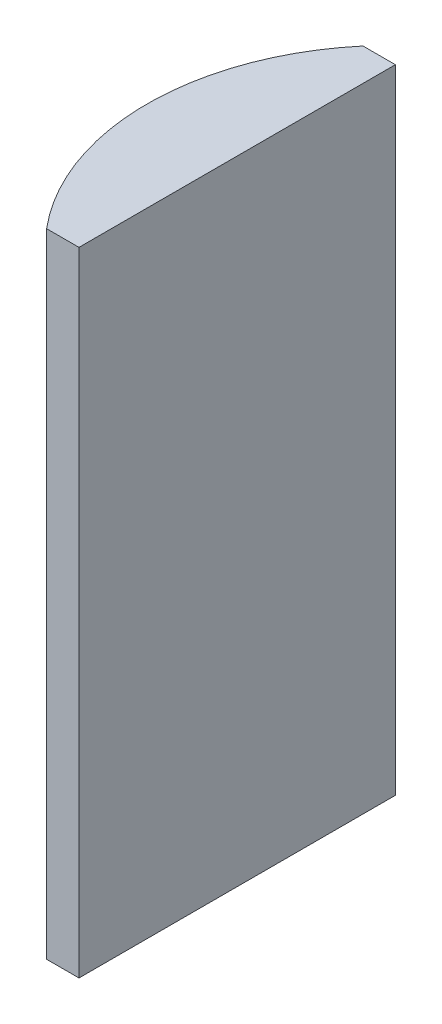
ISO-10303-21;
HEADER;
FILE_DESCRIPTION(('STEP AP214'),'2;1');
FILE_NAME('part.step','',(''),(''),'','','');
FILE_SCHEMA(('AUTOMOTIVE_DESIGN { 1 0 10303 214 1 1 1 1 }'));
ENDSEC;
DATA;
#1=APPLICATION_CONTEXT('core data for automotive mechanical design processes');
#2=APPLICATION_PROTOCOL_DEFINITION('international standard','automotive_design',2000,#1);
#3=PRODUCT_CONTEXT('',#1,'mechanical');
#4=PRODUCT('Part','Part','',(#3));
#5=PRODUCT_RELATED_PRODUCT_CATEGORY('part','',(#4));
#6=PRODUCT_DEFINITION_FORMATION('','',#4);
#7=PRODUCT_DEFINITION_CONTEXT('part definition',#1,'design');
#8=PRODUCT_DEFINITION('design','',#6,#7);
#9=PRODUCT_DEFINITION_SHAPE('','',#8);
#10=(LENGTH_UNIT() NAMED_UNIT(*) SI_UNIT(.MILLI.,.METRE.));
#11=(NAMED_UNIT(*) PLANE_ANGLE_UNIT() SI_UNIT($,.RADIAN.));
#12=(NAMED_UNIT(*) SI_UNIT($,.STERADIAN.) SOLID_ANGLE_UNIT());
#13=UNCERTAINTY_MEASURE_WITH_UNIT(LENGTH_MEASURE(1.E-05),#10,'distance_accuracy_value','');
#14=(GEOMETRIC_REPRESENTATION_CONTEXT(3) GLOBAL_UNCERTAINTY_ASSIGNED_CONTEXT((#13)) GLOBAL_UNIT_ASSIGNED_CONTEXT((#10,
#11,#12)) REPRESENTATION_CONTEXT('',''));
#15=CARTESIAN_POINT('',(0.,0.,0.));
#16=DIRECTION('',(0.,0.,1.));
#17=DIRECTION('',(1.,0.,0.));
#18=AXIS2_PLACEMENT_3D('',#15,#16,#17);
#19=CARTESIAN_POINT('',(4.35520433485127,40.,0.));
#20=DIRECTION('',(0.,-1.,0.));
#21=DIRECTION('',(0.,0.,-1.));
#22=AXIS2_PLACEMENT_3D('',#19,#20,#21);
#23=CYLINDRICAL_SURFACE('',#22,15.51);
#24=CARTESIAN_POINT('',(4.35520433485127,0.,0.));
#25=DIRECTION('',(0.,1.,0.));
#26=DIRECTION('',(0.,0.,1.));
#27=AXIS2_PLACEMENT_3D('',#24,#25,#26);
#28=CIRCLE('',#27,15.51);
#29=CARTESIAN_POINT('',(-7.50060015071613,0.,-10.));
#30=VERTEX_POINT('',#29);
#31=CARTESIAN_POINT('',(-7.50060015071613,0.,10.));
#32=VERTEX_POINT('',#31);
#33=EDGE_CURVE('E100',#30,#32,#28,.T.);
#34=ORIENTED_EDGE('',*,*,#33,.T.);
#35=DIRECTION('',(0.,-1.,0.));
#36=VECTOR('',#35,1.);
#37=CARTESIAN_POINT('',(-7.50060015071613,40.,10.));
#38=LINE('',#37,#36);
#39=CARTESIAN_POINT('',(-7.50060015071613,40.,10.));
#40=VERTEX_POINT('',#39);
#41=EDGE_CURVE('E11',#40,#32,#38,.T.);
#42=ORIENTED_EDGE('',*,*,#41,.F.);
#43=CARTESIAN_POINT('',(4.35520433485127,40.,0.));
#44=DIRECTION('',(0.,1.,0.));
#45=DIRECTION('',(0.,0.,1.));
#46=AXIS2_PLACEMENT_3D('',#43,#44,#45);
#47=CIRCLE('',#46,15.51);
#48=CARTESIAN_POINT('',(-7.50060015071613,40.,-10.));
#49=VERTEX_POINT('',#48);
#50=EDGE_CURVE('E88',#49,#40,#47,.T.);
#51=ORIENTED_EDGE('',*,*,#50,.F.);
#52=DIRECTION('',(0.,-1.,0.));
#53=VECTOR('',#52,1.);
#54=CARTESIAN_POINT('',(-7.50060015071613,40.,-10.));
#55=LINE('',#54,#53);
#56=EDGE_CURVE('E96',#49,#30,#55,.T.);
#57=ORIENTED_EDGE('',*,*,#56,.T.);
#58=EDGE_LOOP('',(#34,#42,#51,#57));
#59=FACE_BOUND('',#58,.T.);
#60=ADVANCED_FACE('F37',(#59),#23,.T.);
#61=CARTESIAN_POINT('',(-7.50060015071613,40.,10.));
#62=DIRECTION('',(0.,0.,-1.));
#63=DIRECTION('',(-1.,0.,0.));
#64=AXIS2_PLACEMENT_3D('',#61,#62,#63);
#65=PLANE('',#64);
#66=DIRECTION('',(1.,0.,0.));
#67=VECTOR('',#66,1.);
#68=CARTESIAN_POINT('',(-7.50060015071613,0.,10.));
#69=LINE('',#68,#67);
#70=CARTESIAN_POINT('',(-5.45479566514873,0.,10.));
#71=VERTEX_POINT('',#70);
#72=EDGE_CURVE('E92',#32,#71,#69,.T.);
#73=ORIENTED_EDGE('',*,*,#72,.T.);
#74=DIRECTION('',(0.,-1.,0.));
#75=VECTOR('',#74,1.);
#76=CARTESIAN_POINT('',(-5.45479566514873,40.,10.));
#77=LINE('',#76,#75);
#78=CARTESIAN_POINT('',(-5.45479566514873,40.,10.));
#79=VERTEX_POINT('',#78);
#80=EDGE_CURVE('E45',#79,#71,#77,.T.);
#81=ORIENTED_EDGE('',*,*,#80,.F.);
#82=DIRECTION('',(1.,0.,0.));
#83=VECTOR('',#82,1.);
#84=CARTESIAN_POINT('',(-7.50060015071613,40.,10.));
#85=LINE('',#84,#83);
#86=EDGE_CURVE('E83',#40,#79,#85,.T.);
#87=ORIENTED_EDGE('',*,*,#86,.F.);
#88=ORIENTED_EDGE('',*,*,#41,.T.);
#89=EDGE_LOOP('',(#73,#81,#87,#88));
#90=FACE_BOUND('',#89,.T.);
#91=ADVANCED_FACE('F91',(#90),#65,.F.);
#92=CARTESIAN_POINT('',(-5.45479566514874,40.,-10.));
#93=DIRECTION('',(-1.,0.,0.));
#94=DIRECTION('',(0.,0.,1.));
#95=AXIS2_PLACEMENT_3D('',#92,#93,#94);
#96=PLANE('',#95);
#97=DIRECTION('',(0.,0.,-1.));
#98=VECTOR('',#97,1.);
#99=CARTESIAN_POINT('',(-5.45479566514874,0.,-10.));
#100=LINE('',#99,#98);
#101=CARTESIAN_POINT('',(-5.45479566514874,0.,-10.));
#102=VERTEX_POINT('',#101);
#103=EDGE_CURVE('E70',#71,#102,#100,.T.);
#104=ORIENTED_EDGE('',*,*,#103,.T.);
#105=DIRECTION('',(0.,-1.,0.));
#106=VECTOR('',#105,1.);
#107=CARTESIAN_POINT('',(-5.45479566514874,40.,-10.));
#108=LINE('',#107,#106);
#109=CARTESIAN_POINT('',(-5.45479566514874,40.,-10.));
#110=VERTEX_POINT('',#109);
#111=EDGE_CURVE('E93',#110,#102,#108,.T.);
#112=ORIENTED_EDGE('',*,*,#111,.F.);
#113=DIRECTION('',(0.,0.,-1.));
#114=VECTOR('',#113,1.);
#115=CARTESIAN_POINT('',(-5.45479566514874,40.,-10.));
#116=LINE('',#115,#114);
#117=EDGE_CURVE('E86',#79,#110,#116,.T.);
#118=ORIENTED_EDGE('',*,*,#117,.F.);
#119=ORIENTED_EDGE('',*,*,#80,.T.);
#120=EDGE_LOOP('',(#104,#112,#118,#119));
#121=FACE_BOUND('',#120,.T.);
#122=ADVANCED_FACE('F94',(#121),#96,.F.);
#123=CARTESIAN_POINT('',(-7.50060015071613,40.,-10.));
#124=DIRECTION('',(0.,0.,1.));
#125=DIRECTION('',(1.,0.,0.));
#126=AXIS2_PLACEMENT_3D('',#123,#124,#125);
#127=PLANE('',#126);
#128=DIRECTION('',(-1.,0.,0.));
#129=VECTOR('',#128,1.);
#130=CARTESIAN_POINT('',(-7.50060015071613,0.,-10.));
#131=LINE('',#130,#129);
#132=EDGE_CURVE('E76',#102,#30,#131,.T.);
#133=ORIENTED_EDGE('',*,*,#132,.T.);
#134=ORIENTED_EDGE('',*,*,#56,.F.);
#135=DIRECTION('',(-1.,0.,0.));
#136=VECTOR('',#135,1.);
#137=CARTESIAN_POINT('',(-7.50060015071613,40.,-10.));
#138=LINE('',#137,#136);
#139=EDGE_CURVE('E53',#110,#49,#138,.T.);
#140=ORIENTED_EDGE('',*,*,#139,.F.);
#141=ORIENTED_EDGE('',*,*,#111,.T.);
#142=EDGE_LOOP('',(#133,#134,#140,#141));
#143=FACE_BOUND('',#142,.T.);
#144=ADVANCED_FACE('F107',(#143),#127,.F.);
#145=CARTESIAN_POINT('',(4.35520433485127,40.,0.));
#146=DIRECTION('',(0.,1.,0.));
#147=DIRECTION('',(0.,0.,1.));
#148=AXIS2_PLACEMENT_3D('',#145,#146,#147);
#149=PLANE('',#148);
#150=ORIENTED_EDGE('',*,*,#50,.T.);
#151=ORIENTED_EDGE('',*,*,#86,.T.);
#152=ORIENTED_EDGE('',*,*,#117,.T.);
#153=ORIENTED_EDGE('',*,*,#139,.T.);
#154=EDGE_LOOP('',(#150,#151,#152,#153));
#155=FACE_BOUND('',#154,.T.);
#156=ADVANCED_FACE('F84',(#155),#149,.T.);
#157=CARTESIAN_POINT('',(4.35520433485127,0.,0.));
#158=DIRECTION('',(0.,1.,0.));
#159=DIRECTION('',(0.,0.,1.));
#160=AXIS2_PLACEMENT_3D('',#157,#158,#159);
#161=PLANE('',#160);
#162=ORIENTED_EDGE('',*,*,#33,.F.);
#163=ORIENTED_EDGE('',*,*,#132,.F.);
#164=ORIENTED_EDGE('',*,*,#103,.F.);
#165=ORIENTED_EDGE('',*,*,#72,.F.);
#166=EDGE_LOOP('',(#162,#163,#164,#165));
#167=FACE_BOUND('',#166,.T.);
#168=ADVANCED_FACE('F110',(#167),#161,.F.);
#169=CLOSED_SHELL('',(#60,#91,#122,#144,#156,#168));
#170=MANIFOLD_SOLID_BREP('B2',#169);
#171=ADVANCED_BREP_SHAPE_REPRESENTATION('',(#18,#170),#14);
#172=SHAPE_DEFINITION_REPRESENTATION(#9,#171);
ENDSEC;
END-ISO-10303-21;
